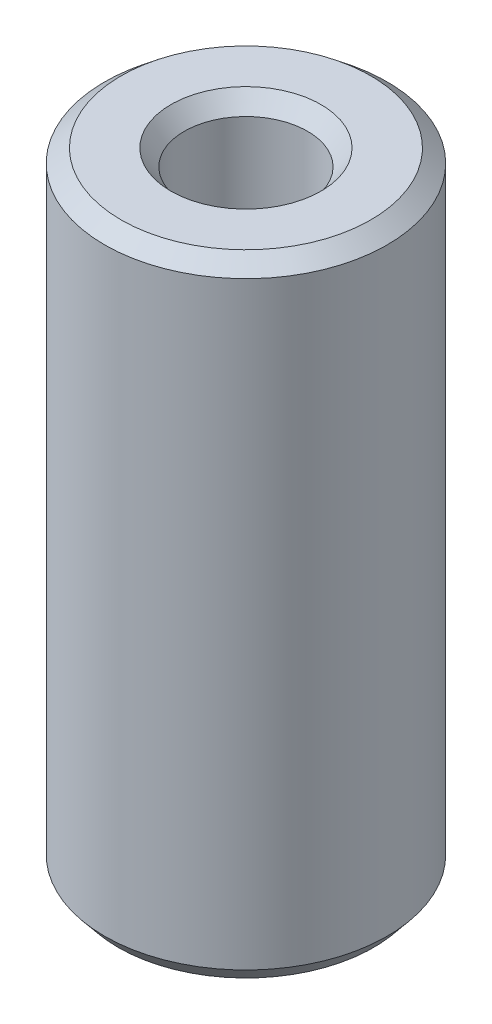
ISO-10303-21;
HEADER;
FILE_DESCRIPTION(('STEP AP214'),'2;1');
FILE_NAME('part.step','',(''),(''),'','','');
FILE_SCHEMA(('AUTOMOTIVE_DESIGN { 1 0 10303 214 1 1 1 1 }'));
ENDSEC;
DATA;
#1=APPLICATION_CONTEXT('core data for automotive mechanical design processes');
#2=APPLICATION_PROTOCOL_DEFINITION('international standard','automotive_design',2000,#1);
#3=PRODUCT_CONTEXT('',#1,'mechanical');
#4=PRODUCT('Part','Part','',(#3));
#5=PRODUCT_RELATED_PRODUCT_CATEGORY('part','',(#4));
#6=PRODUCT_DEFINITION_FORMATION('','',#4);
#7=PRODUCT_DEFINITION_CONTEXT('part definition',#1,'design');
#8=PRODUCT_DEFINITION('design','',#6,#7);
#9=PRODUCT_DEFINITION_SHAPE('','',#8);
#10=(LENGTH_UNIT() NAMED_UNIT(*) SI_UNIT(.MILLI.,.METRE.));
#11=(NAMED_UNIT(*) PLANE_ANGLE_UNIT() SI_UNIT($,.RADIAN.));
#12=(NAMED_UNIT(*) SI_UNIT($,.STERADIAN.) SOLID_ANGLE_UNIT());
#13=UNCERTAINTY_MEASURE_WITH_UNIT(LENGTH_MEASURE(1.E-05),#10,'distance_accuracy_value','');
#14=(GEOMETRIC_REPRESENTATION_CONTEXT(3) GLOBAL_UNCERTAINTY_ASSIGNED_CONTEXT((#13)) GLOBAL_UNIT_ASSIGNED_CONTEXT((#10,
#11,#12)) REPRESENTATION_CONTEXT('',''));
#15=CARTESIAN_POINT('',(0.,0.,0.));
#16=DIRECTION('',(0.,0.,1.));
#17=DIRECTION('',(1.,0.,0.));
#18=AXIS2_PLACEMENT_3D('',#15,#16,#17);
#19=CARTESIAN_POINT('',(0.,88.9959251459714,0.));
#20=DIRECTION('',(0.,-1.,0.));
#21=DIRECTION('',(0.,0.,-1.));
#22=AXIS2_PLACEMENT_3D('',#19,#20,#21);
#23=CYLINDRICAL_SURFACE('',#22,20.);
#24=CARTESIAN_POINT('',(0.,2.32493534010299,0.));
#25=DIRECTION('',(0.,1.,0.));
#26=DIRECTION('',(0.,0.,1.));
#27=AXIS2_PLACEMENT_3D('',#24,#25,#26);
#28=CIRCLE('',#27,20.);
#29=CARTESIAN_POINT('',(0.,2.32493534010299,20.));
#30=VERTEX_POINT('',#29);
#31=EDGE_CURVE('E10',#30,#30,#28,.T.);
#32=ORIENTED_EDGE('',*,*,#31,.T.);
#33=EDGE_LOOP('',(#32));
#34=FACE_BOUND('',#33,.T.);
#35=CARTESIAN_POINT('',(0.,87.0956174140094,0.));
#36=DIRECTION('',(0.,1.,0.));
#37=DIRECTION('',(0.,0.,1.));
#38=AXIS2_PLACEMENT_3D('',#35,#36,#37);
#39=CIRCLE('',#38,20.);
#40=CARTESIAN_POINT('',(0.,87.0956174140094,20.));
#41=VERTEX_POINT('',#40);
#42=EDGE_CURVE('E50',#41,#41,#39,.F.);
#43=ORIENTED_EDGE('',*,*,#42,.T.);
#44=EDGE_LOOP('',(#43));
#45=FACE_BOUND('',#44,.T.);
#46=ADVANCED_FACE('F39',(#34,#45),#23,.T.);
#47=CARTESIAN_POINT('',(0.,88.9959251459714,0.));
#48=DIRECTION('',(0.,1.,0.));
#49=DIRECTION('',(0.,0.,1.));
#50=AXIS2_PLACEMENT_3D('',#47,#48,#49);
#51=PLANE('',#50);
#52=CARTESIAN_POINT('',(0.,88.9959251459714,0.));
#53=DIRECTION('',(0.,1.,0.));
#54=DIRECTION('',(0.,0.,1.));
#55=AXIS2_PLACEMENT_3D('',#52,#53,#54);
#56=CIRCLE('',#55,10.6265296439667);
#57=CARTESIAN_POINT('',(0.,88.9959251459714,10.6265296439667));
#58=VERTEX_POINT('',#57);
#59=EDGE_CURVE('E58',#58,#58,#56,.F.);
#60=ORIENTED_EDGE('',*,*,#59,.T.);
#61=EDGE_LOOP('',(#60));
#62=FACE_BOUND('',#61,.T.);
#63=CARTESIAN_POINT('',(0.,88.9959251459714,0.));
#64=DIRECTION('',(0.,1.,0.));
#65=DIRECTION('',(0.,0.,1.));
#66=AXIS2_PLACEMENT_3D('',#63,#64,#65);
#67=CIRCLE('',#66,17.675064659897);
#68=CARTESIAN_POINT('',(0.,88.9959251459714,17.675064659897));
#69=VERTEX_POINT('',#68);
#70=EDGE_CURVE('E61',#69,#69,#67,.T.);
#71=ORIENTED_EDGE('',*,*,#70,.T.);
#72=EDGE_LOOP('',(#71));
#73=FACE_BOUND('',#72,.T.);
#74=ADVANCED_FACE('F88',(#62,#73),#51,.T.);
#75=CARTESIAN_POINT('',(0.,0.,0.));
#76=DIRECTION('',(0.,1.,0.));
#77=DIRECTION('',(0.,0.,1.));
#78=AXIS2_PLACEMENT_3D('',#75,#76,#77);
#79=PLANE('',#78);
#80=CARTESIAN_POINT('',(0.,0.,0.));
#81=DIRECTION('',(0.,1.,0.));
#82=DIRECTION('',(0.,0.,1.));
#83=AXIS2_PLACEMENT_3D('',#80,#81,#82);
#84=CIRCLE('',#83,11.0511572521077);
#85=CARTESIAN_POINT('',(0.,0.,11.0511572521077));
#86=VERTEX_POINT('',#85);
#87=EDGE_CURVE('E51',#86,#86,#84,.T.);
#88=ORIENTED_EDGE('',*,*,#87,.T.);
#89=EDGE_LOOP('',(#88));
#90=FACE_BOUND('',#89,.T.);
#91=CARTESIAN_POINT('',(0.,0.,0.));
#92=DIRECTION('',(0.,1.,0.));
#93=DIRECTION('',(0.,0.,1.));
#94=AXIS2_PLACEMENT_3D('',#91,#92,#93);
#95=CIRCLE('',#94,18.099692268038);
#96=CARTESIAN_POINT('',(0.,0.,18.099692268038));
#97=VERTEX_POINT('',#96);
#98=EDGE_CURVE('E54',#97,#97,#95,.F.);
#99=ORIENTED_EDGE('',*,*,#98,.T.);
#100=EDGE_LOOP('',(#99));
#101=FACE_BOUND('',#100,.T.);
#102=ADVANCED_FACE('F83',(#90,#101),#79,.F.);
#103=CARTESIAN_POINT('',(0.,88.9959251459714,0.));
#104=DIRECTION('',(0.,-1.,0.));
#105=DIRECTION('',(0.,0.,-1.));
#106=AXIS2_PLACEMENT_3D('',#103,#104,#105);
#107=CYLINDRICAL_SURFACE('',#106,8.72622191200466);
#108=CARTESIAN_POINT('',(0.,86.6709898058684,0.));
#109=DIRECTION('',(0.,1.,0.));
#110=DIRECTION('',(0.,0.,1.));
#111=AXIS2_PLACEMENT_3D('',#108,#109,#110);
#112=CIRCLE('',#111,8.72622191200466);
#113=CARTESIAN_POINT('',(0.,86.6709898058684,8.72622191200466));
#114=VERTEX_POINT('',#113);
#115=EDGE_CURVE('E67',#114,#114,#112,.T.);
#116=ORIENTED_EDGE('',*,*,#115,.T.);
#117=EDGE_LOOP('',(#116));
#118=FACE_BOUND('',#117,.T.);
#119=CARTESIAN_POINT('',(0.,1.90030773196198,0.));
#120=DIRECTION('',(0.,1.,0.));
#121=DIRECTION('',(0.,0.,1.));
#122=AXIS2_PLACEMENT_3D('',#119,#120,#121);
#123=CIRCLE('',#122,8.72622191200466);
#124=CARTESIAN_POINT('',(0.,1.90030773196198,8.72622191200466));
#125=VERTEX_POINT('',#124);
#126=EDGE_CURVE('E69',#125,#125,#123,.F.);
#127=ORIENTED_EDGE('',*,*,#126,.T.);
#128=EDGE_LOOP('',(#127));
#129=FACE_BOUND('',#128,.T.);
#130=ADVANCED_FACE('F71',(#118,#129),#107,.F.);
#131=CARTESIAN_POINT('',(0.,86.6709898058684,0.));
#132=DIRECTION('',(0.,1.,0.));
#133=DIRECTION('',(0.,0.,1.));
#134=AXIS2_PLACEMENT_3D('',#131,#132,#133);
#135=CONICAL_SURFACE('',#134,8.72622191200466,0.685236669823373);
#136=ORIENTED_EDGE('',*,*,#59,.F.);
#137=EDGE_LOOP('',(#136));
#138=FACE_BOUND('',#137,.T.);
#139=ORIENTED_EDGE('',*,*,#115,.F.);
#140=EDGE_LOOP('',(#139));
#141=FACE_BOUND('',#140,.T.);
#142=ADVANCED_FACE('F77',(#138,#141),#135,.F.);
#143=CARTESIAN_POINT('',(0.,0.,0.));
#144=DIRECTION('',(0.,-1.,0.));
#145=DIRECTION('',(0.,0.,-1.));
#146=AXIS2_PLACEMENT_3D('',#143,#144,#145);
#147=CONICAL_SURFACE('',#146,11.0511572521077,0.885559656971522);
#148=ORIENTED_EDGE('',*,*,#126,.F.);
#149=EDGE_LOOP('',(#148));
#150=FACE_BOUND('',#149,.T.);
#151=ORIENTED_EDGE('',*,*,#87,.F.);
#152=EDGE_LOOP('',(#151));
#153=FACE_BOUND('',#152,.T.);
#154=ADVANCED_FACE('F73',(#150,#153),#147,.F.);
#155=CARTESIAN_POINT('',(0.,2.32493534010299,0.));
#156=DIRECTION('',(0.,1.,0.));
#157=DIRECTION('',(0.,0.,1.));
#158=AXIS2_PLACEMENT_3D('',#155,#156,#157);
#159=CONICAL_SURFACE('',#158,20.,0.685236669823376);
#160=ORIENTED_EDGE('',*,*,#98,.F.);
#161=EDGE_LOOP('',(#160));
#162=FACE_BOUND('',#161,.T.);
#163=ORIENTED_EDGE('',*,*,#31,.F.);
#164=EDGE_LOOP('',(#163));
#165=FACE_BOUND('',#164,.T.);
#166=ADVANCED_FACE('F76',(#162,#165),#159,.T.);
#167=CARTESIAN_POINT('',(0.,88.9959251459714,0.));
#168=DIRECTION('',(0.,-1.,0.));
#169=DIRECTION('',(0.,0.,-1.));
#170=AXIS2_PLACEMENT_3D('',#167,#168,#169);
#171=CONICAL_SURFACE('',#170,17.675064659897,0.885559656971523);
#172=ORIENTED_EDGE('',*,*,#42,.F.);
#173=EDGE_LOOP('',(#172));
#174=FACE_BOUND('',#173,.T.);
#175=ORIENTED_EDGE('',*,*,#70,.F.);
#176=EDGE_LOOP('',(#175));
#177=FACE_BOUND('',#176,.T.);
#178=ADVANCED_FACE('F45',(#174,#177),#171,.T.);
#179=CLOSED_SHELL('',(#46,#74,#102,#130,#142,#154,#166,#178));
#180=MANIFOLD_SOLID_BREP('B2',#179);
#181=ADVANCED_BREP_SHAPE_REPRESENTATION('',(#18,#180),#14);
#182=SHAPE_DEFINITION_REPRESENTATION(#9,#181);
ENDSEC;
END-ISO-10303-21;
